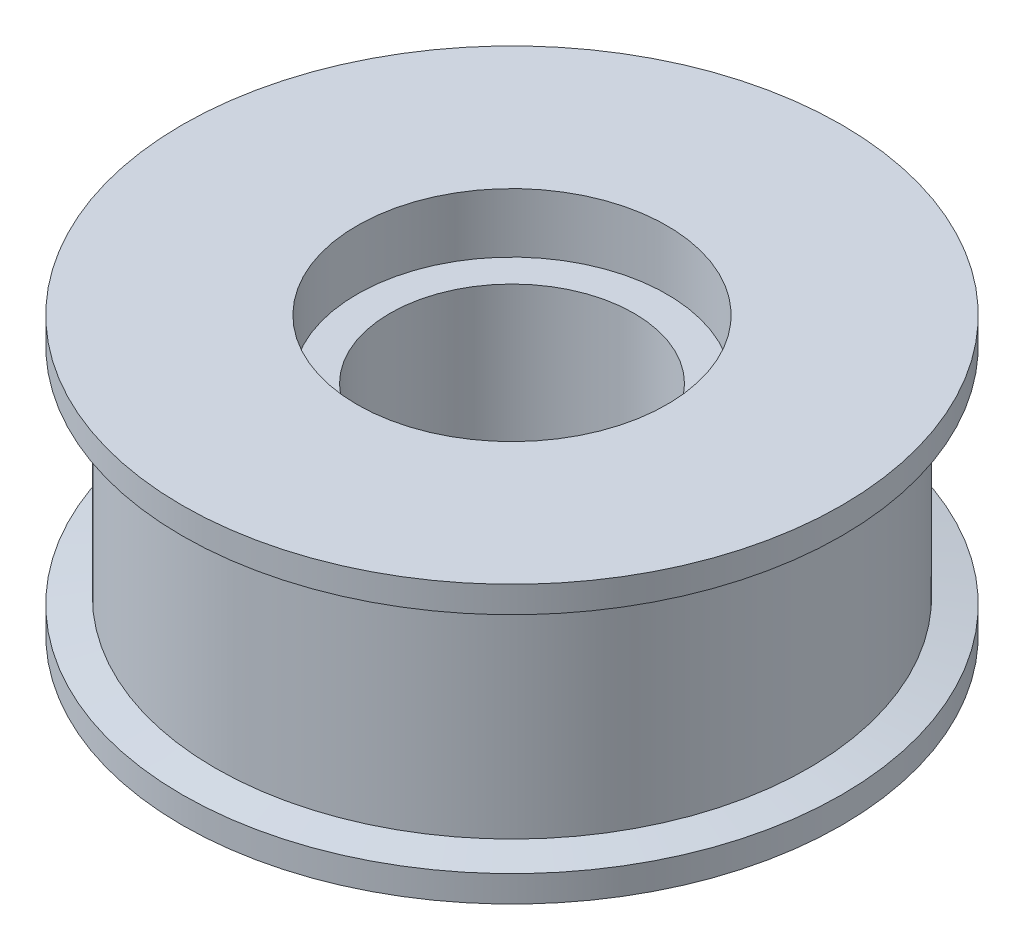
ISO-10303-21;
HEADER;
FILE_DESCRIPTION(('STEP AP214'),'2;1');
FILE_NAME('part.step','',(''),(''),'','','');
FILE_SCHEMA(('AUTOMOTIVE_DESIGN { 1 0 10303 214 1 1 1 1 }'));
ENDSEC;
DATA;
#1=APPLICATION_CONTEXT('core data for automotive mechanical design processes');
#2=APPLICATION_PROTOCOL_DEFINITION('international standard','automotive_design',2000,#1);
#3=PRODUCT_CONTEXT('',#1,'mechanical');
#4=PRODUCT('Part','Part','',(#3));
#5=PRODUCT_RELATED_PRODUCT_CATEGORY('part','',(#4));
#6=PRODUCT_DEFINITION_FORMATION('','',#4);
#7=PRODUCT_DEFINITION_CONTEXT('part definition',#1,'design');
#8=PRODUCT_DEFINITION('design','',#6,#7);
#9=PRODUCT_DEFINITION_SHAPE('','',#8);
#10=(LENGTH_UNIT() NAMED_UNIT(*) SI_UNIT(.MILLI.,.METRE.));
#11=(NAMED_UNIT(*) PLANE_ANGLE_UNIT() SI_UNIT($,.RADIAN.));
#12=(NAMED_UNIT(*) SI_UNIT($,.STERADIAN.) SOLID_ANGLE_UNIT());
#13=UNCERTAINTY_MEASURE_WITH_UNIT(LENGTH_MEASURE(1.E-05),#10,'distance_accuracy_value','');
#14=(GEOMETRIC_REPRESENTATION_CONTEXT(3) GLOBAL_UNCERTAINTY_ASSIGNED_CONTEXT((#13)) GLOBAL_UNIT_ASSIGNED_CONTEXT((#10,
#11,#12)) REPRESENTATION_CONTEXT('',''));
#15=CARTESIAN_POINT('',(0.,0.,0.));
#16=DIRECTION('',(0.,0.,1.));
#17=DIRECTION('',(1.,0.,0.));
#18=AXIS2_PLACEMENT_3D('',#15,#16,#17);
#19=CARTESIAN_POINT('',(-23.5,19.,0.));
#20=DIRECTION('',(0.,1.,0.));
#21=DIRECTION('',(0.,0.,1.));
#22=AXIS2_PLACEMENT_3D('',#19,#20,#21);
#23=PLANE('',#22);
#24=CARTESIAN_POINT('',(0.,19.,0.));
#25=DIRECTION('',(0.,1.,0.));
#26=DIRECTION('',(0.,0.,1.));
#27=AXIS2_PLACEMENT_3D('',#24,#25,#26);
#28=CIRCLE('',#27,50.);
#29=CARTESIAN_POINT('',(0.,19.,50.));
#30=VERTEX_POINT('',#29);
#31=EDGE_CURVE('E10',#30,#30,#28,.T.);
#32=ORIENTED_EDGE('',*,*,#31,.T.);
#33=EDGE_LOOP('',(#32));
#34=FACE_BOUND('',#33,.T.);
#35=CARTESIAN_POINT('',(0.,19.,0.));
#36=DIRECTION('',(0.,1.,0.));
#37=DIRECTION('',(0.,0.,1.));
#38=AXIS2_PLACEMENT_3D('',#35,#36,#37);
#39=CIRCLE('',#38,23.5);
#40=CARTESIAN_POINT('',(0.,19.,23.5));
#41=VERTEX_POINT('',#40);
#42=EDGE_CURVE('E72',#41,#41,#39,.T.);
#43=ORIENTED_EDGE('',*,*,#42,.F.);
#44=EDGE_LOOP('',(#43));
#45=FACE_BOUND('',#44,.T.);
#46=ADVANCED_FACE('F32',(#34,#45),#23,.T.);
#47=CARTESIAN_POINT('',(0.,49.7269479059982,0.));
#48=DIRECTION('',(0.,1.,0.));
#49=DIRECTION('',(0.,0.,1.));
#50=AXIS2_PLACEMENT_3D('',#47,#48,#49);
#51=CYLINDRICAL_SURFACE('',#50,50.);
#52=CARTESIAN_POINT('',(0.,15.,0.));
#53=DIRECTION('',(0.,1.,0.));
#54=DIRECTION('',(0.,0.,1.));
#55=AXIS2_PLACEMENT_3D('',#52,#53,#54);
#56=CIRCLE('',#55,50.);
#57=CARTESIAN_POINT('',(0.,15.,50.));
#58=VERTEX_POINT('',#57);
#59=EDGE_CURVE('E38',#58,#58,#56,.T.);
#60=ORIENTED_EDGE('',*,*,#59,.T.);
#61=EDGE_LOOP('',(#60));
#62=FACE_BOUND('',#61,.T.);
#63=ORIENTED_EDGE('',*,*,#31,.F.);
#64=EDGE_LOOP('',(#63));
#65=FACE_BOUND('',#64,.T.);
#66=ADVANCED_FACE('F80',(#62,#65),#51,.T.);
#67=CARTESIAN_POINT('',(0.,15.,0.));
#68=DIRECTION('',(0.,1.,0.));
#69=DIRECTION('',(0.,0.,1.));
#70=AXIS2_PLACEMENT_3D('',#67,#68,#69);
#71=CONICAL_SURFACE('',#70,50.,1.37340076694502);
#72=CARTESIAN_POINT('',(0.,14.,0.));
#73=DIRECTION('',(0.,1.,0.));
#74=DIRECTION('',(0.,0.,1.));
#75=AXIS2_PLACEMENT_3D('',#72,#73,#74);
#76=CIRCLE('',#75,45.);
#77=CARTESIAN_POINT('',(0.,14.,45.));
#78=VERTEX_POINT('',#77);
#79=EDGE_CURVE('E42',#78,#78,#76,.T.);
#80=ORIENTED_EDGE('',*,*,#79,.T.);
#81=EDGE_LOOP('',(#80));
#82=FACE_BOUND('',#81,.T.);
#83=ORIENTED_EDGE('',*,*,#59,.F.);
#84=EDGE_LOOP('',(#83));
#85=FACE_BOUND('',#84,.T.);
#86=ADVANCED_FACE('F84',(#82,#85),#71,.T.);
#87=CARTESIAN_POINT('',(0.,49.7269479059982,0.));
#88=DIRECTION('',(0.,1.,0.));
#89=DIRECTION('',(0.,0.,1.));
#90=AXIS2_PLACEMENT_3D('',#87,#88,#89);
#91=CYLINDRICAL_SURFACE('',#90,45.);
#92=CARTESIAN_POINT('',(0.,-18.,0.));
#93=DIRECTION('',(0.,1.,0.));
#94=DIRECTION('',(0.,0.,1.));
#95=AXIS2_PLACEMENT_3D('',#92,#93,#94);
#96=CIRCLE('',#95,45.);
#97=CARTESIAN_POINT('',(0.,-18.,45.));
#98=VERTEX_POINT('',#97);
#99=EDGE_CURVE('E46',#98,#98,#96,.T.);
#100=ORIENTED_EDGE('',*,*,#99,.T.);
#101=EDGE_LOOP('',(#100));
#102=FACE_BOUND('',#101,.T.);
#103=ORIENTED_EDGE('',*,*,#79,.F.);
#104=EDGE_LOOP('',(#103));
#105=FACE_BOUND('',#104,.T.);
#106=ADVANCED_FACE('F88',(#102,#105),#91,.T.);
#107=CARTESIAN_POINT('',(0.,-18.,0.));
#108=DIRECTION('',(0.,-1.,0.));
#109=DIRECTION('',(0.,0.,-1.));
#110=AXIS2_PLACEMENT_3D('',#107,#108,#109);
#111=CONICAL_SURFACE('',#110,45.,1.37340076694502);
#112=CARTESIAN_POINT('',(0.,-19.,0.));
#113=DIRECTION('',(0.,1.,0.));
#114=DIRECTION('',(0.,0.,1.));
#115=AXIS2_PLACEMENT_3D('',#112,#113,#114);
#116=CIRCLE('',#115,50.);
#117=CARTESIAN_POINT('',(0.,-19.,50.));
#118=VERTEX_POINT('',#117);
#119=EDGE_CURVE('E51',#118,#118,#116,.T.);
#120=ORIENTED_EDGE('',*,*,#119,.T.);
#121=EDGE_LOOP('',(#120));
#122=FACE_BOUND('',#121,.T.);
#123=ORIENTED_EDGE('',*,*,#99,.F.);
#124=EDGE_LOOP('',(#123));
#125=FACE_BOUND('',#124,.T.);
#126=ADVANCED_FACE('F95',(#122,#125),#111,.T.);
#127=CARTESIAN_POINT('',(0.,49.7269479059982,0.));
#128=DIRECTION('',(0.,1.,0.));
#129=DIRECTION('',(0.,0.,1.));
#130=AXIS2_PLACEMENT_3D('',#127,#128,#129);
#131=CYLINDRICAL_SURFACE('',#130,50.);
#132=CARTESIAN_POINT('',(0.,-23.,0.));
#133=DIRECTION('',(0.,1.,0.));
#134=DIRECTION('',(0.,0.,1.));
#135=AXIS2_PLACEMENT_3D('',#132,#133,#134);
#136=CIRCLE('',#135,50.);
#137=CARTESIAN_POINT('',(0.,-23.,50.));
#138=VERTEX_POINT('',#137);
#139=EDGE_CURVE('E54',#138,#138,#136,.T.);
#140=ORIENTED_EDGE('',*,*,#139,.T.);
#141=EDGE_LOOP('',(#140));
#142=FACE_BOUND('',#141,.T.);
#143=ORIENTED_EDGE('',*,*,#119,.F.);
#144=EDGE_LOOP('',(#143));
#145=FACE_BOUND('',#144,.T.);
#146=ADVANCED_FACE('F99',(#142,#145),#131,.T.);
#147=CARTESIAN_POINT('',(-23.5,-23.,0.));
#148=DIRECTION('',(0.,-1.,0.));
#149=DIRECTION('',(0.,0.,-1.));
#150=AXIS2_PLACEMENT_3D('',#147,#148,#149);
#151=PLANE('',#150);
#152=CARTESIAN_POINT('',(0.,-23.,0.));
#153=DIRECTION('',(0.,1.,0.));
#154=DIRECTION('',(0.,0.,1.));
#155=AXIS2_PLACEMENT_3D('',#152,#153,#154);
#156=CIRCLE('',#155,23.5);
#157=CARTESIAN_POINT('',(0.,-23.,23.5));
#158=VERTEX_POINT('',#157);
#159=EDGE_CURVE('E57',#158,#158,#156,.T.);
#160=ORIENTED_EDGE('',*,*,#159,.T.);
#161=EDGE_LOOP('',(#160));
#162=FACE_BOUND('',#161,.T.);
#163=ORIENTED_EDGE('',*,*,#139,.F.);
#164=EDGE_LOOP('',(#163));
#165=FACE_BOUND('',#164,.T.);
#166=ADVANCED_FACE('F103',(#162,#165),#151,.T.);
#167=CARTESIAN_POINT('',(0.,49.7269479059982,0.));
#168=DIRECTION('',(0.,1.,0.));
#169=DIRECTION('',(0.,0.,1.));
#170=AXIS2_PLACEMENT_3D('',#167,#168,#169);
#171=CYLINDRICAL_SURFACE('',#170,23.5);
#172=CARTESIAN_POINT('',(0.,-14.,0.));
#173=DIRECTION('',(0.,1.,0.));
#174=DIRECTION('',(0.,0.,1.));
#175=AXIS2_PLACEMENT_3D('',#172,#173,#174);
#176=CIRCLE('',#175,23.5);
#177=CARTESIAN_POINT('',(0.,-14.,23.5));
#178=VERTEX_POINT('',#177);
#179=EDGE_CURVE('E60',#178,#178,#176,.T.);
#180=ORIENTED_EDGE('',*,*,#179,.T.);
#181=EDGE_LOOP('',(#180));
#182=FACE_BOUND('',#181,.T.);
#183=ORIENTED_EDGE('',*,*,#159,.F.);
#184=EDGE_LOOP('',(#183));
#185=FACE_BOUND('',#184,.T.);
#186=ADVANCED_FACE('F107',(#182,#185),#171,.F.);
#187=CARTESIAN_POINT('',(-18.5,-14.,0.));
#188=DIRECTION('',(0.,-1.,0.));
#189=DIRECTION('',(0.,0.,-1.));
#190=AXIS2_PLACEMENT_3D('',#187,#188,#189);
#191=PLANE('',#190);
#192=CARTESIAN_POINT('',(0.,-14.,0.));
#193=DIRECTION('',(0.,1.,0.));
#194=DIRECTION('',(0.,0.,1.));
#195=AXIS2_PLACEMENT_3D('',#192,#193,#194);
#196=CIRCLE('',#195,18.5);
#197=CARTESIAN_POINT('',(0.,-14.,18.5));
#198=VERTEX_POINT('',#197);
#199=EDGE_CURVE('E63',#198,#198,#196,.T.);
#200=ORIENTED_EDGE('',*,*,#199,.T.);
#201=EDGE_LOOP('',(#200));
#202=FACE_BOUND('',#201,.T.);
#203=ORIENTED_EDGE('',*,*,#179,.F.);
#204=EDGE_LOOP('',(#203));
#205=FACE_BOUND('',#204,.T.);
#206=ADVANCED_FACE('F111',(#202,#205),#191,.T.);
#207=CARTESIAN_POINT('',(0.,49.7269479059982,0.));
#208=DIRECTION('',(0.,1.,0.));
#209=DIRECTION('',(0.,0.,1.));
#210=AXIS2_PLACEMENT_3D('',#207,#208,#209);
#211=CYLINDRICAL_SURFACE('',#210,18.5);
#212=CARTESIAN_POINT('',(0.,10.,0.));
#213=DIRECTION('',(0.,1.,0.));
#214=DIRECTION('',(0.,0.,1.));
#215=AXIS2_PLACEMENT_3D('',#212,#213,#214);
#216=CIRCLE('',#215,18.5);
#217=CARTESIAN_POINT('',(0.,10.,18.5));
#218=VERTEX_POINT('',#217);
#219=EDGE_CURVE('E66',#218,#218,#216,.T.);
#220=ORIENTED_EDGE('',*,*,#219,.T.);
#221=EDGE_LOOP('',(#220));
#222=FACE_BOUND('',#221,.T.);
#223=ORIENTED_EDGE('',*,*,#199,.F.);
#224=EDGE_LOOP('',(#223));
#225=FACE_BOUND('',#224,.T.);
#226=ADVANCED_FACE('F115',(#222,#225),#211,.F.);
#227=CARTESIAN_POINT('',(-18.5,10.,0.));
#228=DIRECTION('',(0.,1.,0.));
#229=DIRECTION('',(0.,0.,1.));
#230=AXIS2_PLACEMENT_3D('',#227,#228,#229);
#231=PLANE('',#230);
#232=CARTESIAN_POINT('',(0.,10.,0.));
#233=DIRECTION('',(0.,1.,0.));
#234=DIRECTION('',(0.,0.,1.));
#235=AXIS2_PLACEMENT_3D('',#232,#233,#234);
#236=CIRCLE('',#235,23.5);
#237=CARTESIAN_POINT('',(0.,10.,23.5));
#238=VERTEX_POINT('',#237);
#239=EDGE_CURVE('E69',#238,#238,#236,.T.);
#240=ORIENTED_EDGE('',*,*,#239,.T.);
#241=EDGE_LOOP('',(#240));
#242=FACE_BOUND('',#241,.T.);
#243=ORIENTED_EDGE('',*,*,#219,.F.);
#244=EDGE_LOOP('',(#243));
#245=FACE_BOUND('',#244,.T.);
#246=ADVANCED_FACE('F119',(#242,#245),#231,.T.);
#247=CARTESIAN_POINT('',(0.,49.7269479059982,0.));
#248=DIRECTION('',(0.,1.,0.));
#249=DIRECTION('',(0.,0.,1.));
#250=AXIS2_PLACEMENT_3D('',#247,#248,#249);
#251=CYLINDRICAL_SURFACE('',#250,23.5);
#252=ORIENTED_EDGE('',*,*,#42,.T.);
#253=EDGE_LOOP('',(#252));
#254=FACE_BOUND('',#253,.T.);
#255=ORIENTED_EDGE('',*,*,#239,.F.);
#256=EDGE_LOOP('',(#255));
#257=FACE_BOUND('',#256,.T.);
#258=ADVANCED_FACE('F76',(#254,#257),#251,.F.);
#259=CLOSED_SHELL('',(#46,#66,#86,#106,#126,#146,#166,#186,#206,#226,#246,#258));
#260=MANIFOLD_SOLID_BREP('B2',#259);
#261=ADVANCED_BREP_SHAPE_REPRESENTATION('',(#18,#260),#14);
#262=SHAPE_DEFINITION_REPRESENTATION(#9,#261);
ENDSEC;
END-ISO-10303-21;
